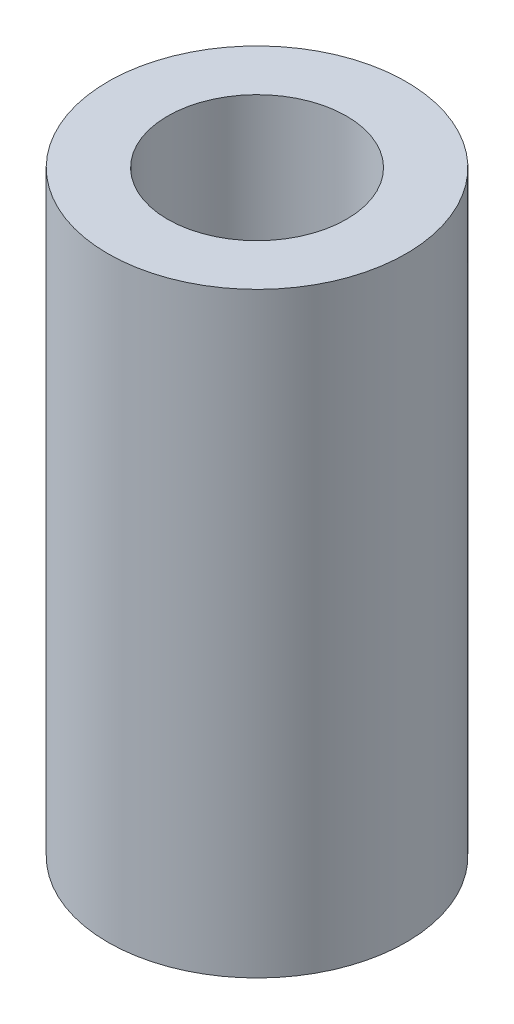
ISO-10303-21;
HEADER;
FILE_DESCRIPTION(('STEP AP214'),'2;1');
FILE_NAME('part.step','',(''),(''),'','','');
FILE_SCHEMA(('AUTOMOTIVE_DESIGN { 1 0 10303 214 1 1 1 1 }'));
ENDSEC;
DATA;
#1=APPLICATION_CONTEXT('core data for automotive mechanical design processes');
#2=APPLICATION_PROTOCOL_DEFINITION('international standard','automotive_design',2000,#1);
#3=PRODUCT_CONTEXT('',#1,'mechanical');
#4=PRODUCT('Part','Part','',(#3));
#5=PRODUCT_RELATED_PRODUCT_CATEGORY('part','',(#4));
#6=PRODUCT_DEFINITION_FORMATION('','',#4);
#7=PRODUCT_DEFINITION_CONTEXT('part definition',#1,'design');
#8=PRODUCT_DEFINITION('design','',#6,#7);
#9=PRODUCT_DEFINITION_SHAPE('','',#8);
#10=(LENGTH_UNIT() NAMED_UNIT(*) SI_UNIT(.MILLI.,.METRE.));
#11=(NAMED_UNIT(*) PLANE_ANGLE_UNIT() SI_UNIT($,.RADIAN.));
#12=(NAMED_UNIT(*) SI_UNIT($,.STERADIAN.) SOLID_ANGLE_UNIT());
#13=UNCERTAINTY_MEASURE_WITH_UNIT(LENGTH_MEASURE(1.E-05),#10,'distance_accuracy_value','');
#14=(GEOMETRIC_REPRESENTATION_CONTEXT(3) GLOBAL_UNCERTAINTY_ASSIGNED_CONTEXT((#13)) GLOBAL_UNIT_ASSIGNED_CONTEXT((#10,
#11,#12)) REPRESENTATION_CONTEXT('',''));
#15=CARTESIAN_POINT('',(0.,0.,0.));
#16=DIRECTION('',(0.,0.,1.));
#17=DIRECTION('',(1.,0.,0.));
#18=AXIS2_PLACEMENT_3D('',#15,#16,#17);
#19=CARTESIAN_POINT('',(0.,8.,0.));
#20=DIRECTION('',(0.,1.,0.));
#21=DIRECTION('',(0.,0.,1.));
#22=AXIS2_PLACEMENT_3D('',#19,#20,#21);
#23=PLANE('',#22);
#24=DIRECTION('',(1.,0.,0.));
#25=VECTOR('',#24,1.);
#26=CARTESIAN_POINT('',(0.,8.,1.3));
#27=LINE('',#26,#25);
#28=CARTESIAN_POINT('',(-1.24498995979887,8.,1.3));
#29=VERTEX_POINT('',#28);
#30=CARTESIAN_POINT('',(1.24498995979887,8.,1.3));
#31=VERTEX_POINT('',#30);
#32=EDGE_CURVE('E75',#29,#31,#27,.T.);
#33=ORIENTED_EDGE('',*,*,#32,.F.);
#34=CARTESIAN_POINT('',(0.,8.,0.));
#35=DIRECTION('',(0.,1.,0.));
#36=DIRECTION('',(0.,0.,1.));
#37=AXIS2_PLACEMENT_3D('',#34,#35,#36);
#38=CIRCLE('',#37,1.8);
#39=EDGE_CURVE('E11',#29,#31,#38,.T.);
#40=ORIENTED_EDGE('',*,*,#39,.T.);
#41=EDGE_LOOP('',(#33,#40));
#42=FACE_BOUND('',#41,.T.);
#43=ADVANCED_FACE('F43',(#42),#23,.T.);
#44=CARTESIAN_POINT('',(0.,8.,0.));
#45=DIRECTION('',(0.,-1.,0.));
#46=DIRECTION('',(0.,0.,-1.));
#47=AXIS2_PLACEMENT_3D('',#44,#45,#46);
#48=CYLINDRICAL_SURFACE('',#47,1.8);
#49=CARTESIAN_POINT('',(0.,0.,0.));
#50=DIRECTION('',(0.,1.,0.));
#51=DIRECTION('',(0.,0.,1.));
#52=AXIS2_PLACEMENT_3D('',#49,#50,#51);
#53=CIRCLE('',#52,1.8);
#54=CARTESIAN_POINT('',(1.24498995979887,0.,1.3));
#55=VERTEX_POINT('',#54);
#56=CARTESIAN_POINT('',(-1.24498995979887,0.,1.3));
#57=VERTEX_POINT('',#56);
#58=EDGE_CURVE('E88',#55,#57,#53,.T.);
#59=ORIENTED_EDGE('',*,*,#58,.F.);
#60=DIRECTION('',(0.,-1.,0.));
#61=VECTOR('',#60,1.);
#62=CARTESIAN_POINT('',(1.24498995979887,8.,1.3));
#63=LINE('',#62,#61);
#64=EDGE_CURVE('E47',#31,#55,#63,.T.);
#65=ORIENTED_EDGE('',*,*,#64,.F.);
#66=ORIENTED_EDGE('',*,*,#39,.F.);
#67=DIRECTION('',(0.,-1.,0.));
#68=VECTOR('',#67,1.);
#69=CARTESIAN_POINT('',(-1.24498995979887,8.,1.3));
#70=LINE('',#69,#68);
#71=EDGE_CURVE('E72',#29,#57,#70,.T.);
#72=ORIENTED_EDGE('',*,*,#71,.T.);
#73=EDGE_LOOP('',(#59,#65,#66,#72));
#74=FACE_BOUND('',#73,.T.);
#75=CARTESIAN_POINT('',(0.,12.,0.));
#76=DIRECTION('',(0.,1.,0.));
#77=DIRECTION('',(0.,0.,1.));
#78=AXIS2_PLACEMENT_3D('',#75,#76,#77);
#79=CIRCLE('',#78,1.8);
#80=CARTESIAN_POINT('',(0.,12.,1.8));
#81=VERTEX_POINT('',#80);
#82=EDGE_CURVE('E108',#81,#81,#79,.T.);
#83=ORIENTED_EDGE('',*,*,#82,.T.);
#84=EDGE_LOOP('',(#83));
#85=FACE_BOUND('',#84,.T.);
#86=ADVANCED_FACE('F45',(#74,#85),#48,.F.);
#87=CARTESIAN_POINT('',(0.,8.,1.3));
#88=DIRECTION('',(0.,0.,-1.));
#89=DIRECTION('',(-1.,0.,0.));
#90=AXIS2_PLACEMENT_3D('',#87,#88,#89);
#91=PLANE('',#90);
#92=DIRECTION('',(1.,0.,0.));
#93=VECTOR('',#92,1.);
#94=CARTESIAN_POINT('',(0.,0.,1.3));
#95=LINE('',#94,#93);
#96=EDGE_CURVE('E77',#57,#55,#95,.T.);
#97=ORIENTED_EDGE('',*,*,#96,.F.);
#98=ORIENTED_EDGE('',*,*,#71,.F.);
#99=ORIENTED_EDGE('',*,*,#32,.T.);
#100=ORIENTED_EDGE('',*,*,#64,.T.);
#101=EDGE_LOOP('',(#97,#98,#99,#100));
#102=FACE_BOUND('',#101,.T.);
#103=ADVANCED_FACE('F74',(#102),#91,.T.);
#104=CARTESIAN_POINT('',(0.,8.,0.));
#105=DIRECTION('',(0.,-1.,0.));
#106=DIRECTION('',(0.,0.,-1.));
#107=AXIS2_PLACEMENT_3D('',#104,#105,#106);
#108=CYLINDRICAL_SURFACE('',#107,3.);
#109=CARTESIAN_POINT('',(0.,0.,0.));
#110=DIRECTION('',(0.,1.,0.));
#111=DIRECTION('',(0.,0.,1.));
#112=AXIS2_PLACEMENT_3D('',#109,#110,#111);
#113=CIRCLE('',#112,3.);
#114=CARTESIAN_POINT('',(0.,0.,3.));
#115=VERTEX_POINT('',#114);
#116=EDGE_CURVE('E80',#115,#115,#113,.T.);
#117=ORIENTED_EDGE('',*,*,#116,.T.);
#118=EDGE_LOOP('',(#117));
#119=FACE_BOUND('',#118,.T.);
#120=CARTESIAN_POINT('',(0.,12.,0.));
#121=DIRECTION('',(0.,1.,0.));
#122=DIRECTION('',(0.,0.,1.));
#123=AXIS2_PLACEMENT_3D('',#120,#121,#122);
#124=CIRCLE('',#123,3.);
#125=CARTESIAN_POINT('',(0.,12.,3.));
#126=VERTEX_POINT('',#125);
#127=EDGE_CURVE('E87',#126,#126,#124,.T.);
#128=ORIENTED_EDGE('',*,*,#127,.F.);
#129=EDGE_LOOP('',(#128));
#130=FACE_BOUND('',#129,.T.);
#131=ADVANCED_FACE('F97',(#119,#130),#108,.T.);
#132=CARTESIAN_POINT('',(0.,0.,0.));
#133=DIRECTION('',(0.,1.,0.));
#134=DIRECTION('',(0.,0.,1.));
#135=AXIS2_PLACEMENT_3D('',#132,#133,#134);
#136=PLANE('',#135);
#137=ORIENTED_EDGE('',*,*,#58,.T.);
#138=ORIENTED_EDGE('',*,*,#96,.T.);
#139=EDGE_LOOP('',(#137,#138));
#140=FACE_BOUND('',#139,.T.);
#141=ORIENTED_EDGE('',*,*,#116,.F.);
#142=EDGE_LOOP('',(#141));
#143=FACE_BOUND('',#142,.T.);
#144=ADVANCED_FACE('F93',(#140,#143),#136,.F.);
#145=CARTESIAN_POINT('',(0.,12.,0.));
#146=DIRECTION('',(0.,1.,0.));
#147=DIRECTION('',(0.,0.,1.));
#148=AXIS2_PLACEMENT_3D('',#145,#146,#147);
#149=PLANE('',#148);
#150=ORIENTED_EDGE('',*,*,#127,.T.);
#151=EDGE_LOOP('',(#150));
#152=FACE_BOUND('',#151,.T.);
#153=ORIENTED_EDGE('',*,*,#82,.F.);
#154=EDGE_LOOP('',(#153));
#155=FACE_BOUND('',#154,.T.);
#156=ADVANCED_FACE('F96',(#152,#155),#149,.T.);
#157=CLOSED_SHELL('',(#43,#86,#103,#131,#144,#156));
#158=MANIFOLD_SOLID_BREP('B2',#157);
#159=ADVANCED_BREP_SHAPE_REPRESENTATION('',(#18,#158),#14);
#160=SHAPE_DEFINITION_REPRESENTATION(#9,#159);
ENDSEC;
END-ISO-10303-21;
